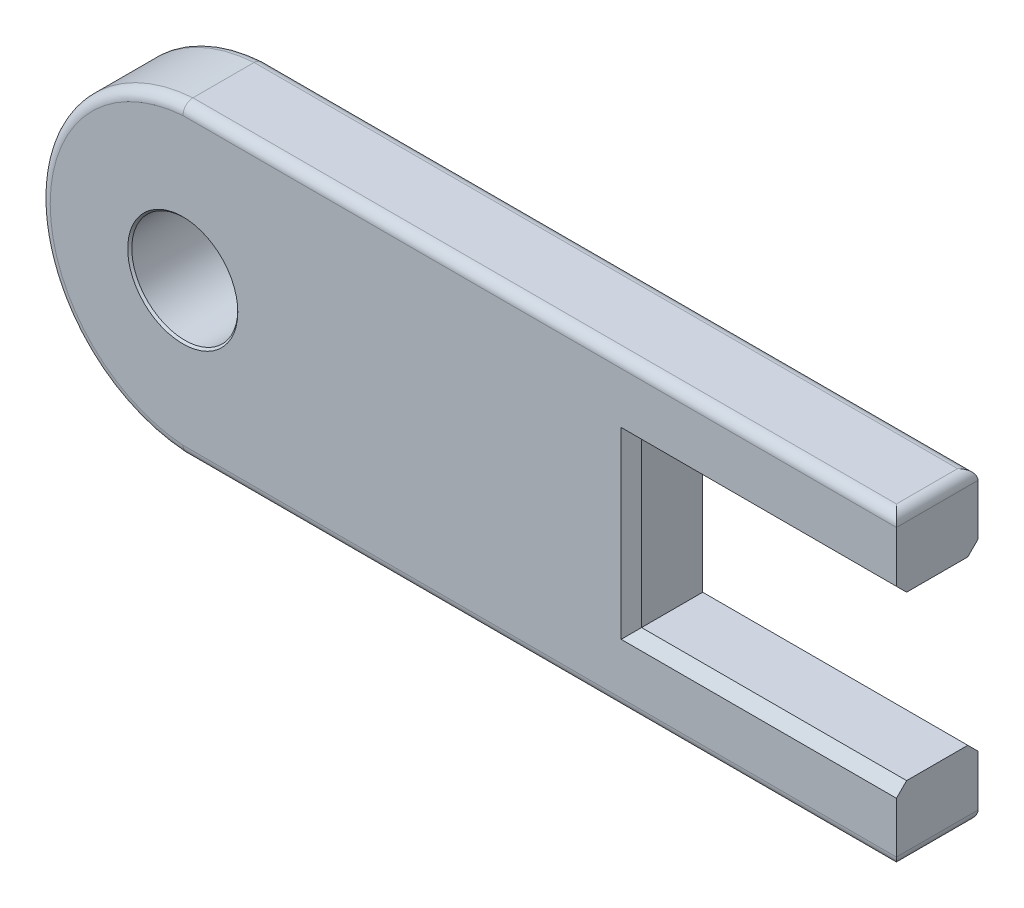
ISO-10303-21;
HEADER;
FILE_DESCRIPTION(('STEP AP214'),'2;1');
FILE_NAME('part.step','',(''),(''),'','','');
FILE_SCHEMA(('AUTOMOTIVE_DESIGN { 1 0 10303 214 1 1 1 1 }'));
ENDSEC;
DATA;
#1=APPLICATION_CONTEXT('core data for automotive mechanical design processes');
#2=APPLICATION_PROTOCOL_DEFINITION('international standard','automotive_design',2000,#1);
#3=PRODUCT_CONTEXT('',#1,'mechanical');
#4=PRODUCT('Part','Part','',(#3));
#5=PRODUCT_RELATED_PRODUCT_CATEGORY('part','',(#4));
#6=PRODUCT_DEFINITION_FORMATION('','',#4);
#7=PRODUCT_DEFINITION_CONTEXT('part definition',#1,'design');
#8=PRODUCT_DEFINITION('design','',#6,#7);
#9=PRODUCT_DEFINITION_SHAPE('','',#8);
#10=(LENGTH_UNIT() NAMED_UNIT(*) SI_UNIT(.MILLI.,.METRE.));
#11=(NAMED_UNIT(*) PLANE_ANGLE_UNIT() SI_UNIT($,.RADIAN.));
#12=(NAMED_UNIT(*) SI_UNIT($,.STERADIAN.) SOLID_ANGLE_UNIT());
#13=UNCERTAINTY_MEASURE_WITH_UNIT(LENGTH_MEASURE(1.E-05),#10,'distance_accuracy_value','');
#14=(GEOMETRIC_REPRESENTATION_CONTEXT(3) GLOBAL_UNCERTAINTY_ASSIGNED_CONTEXT((#13)) GLOBAL_UNIT_ASSIGNED_CONTEXT((#10,
#11,#12)) REPRESENTATION_CONTEXT('',''));
#15=CARTESIAN_POINT('',(0.,0.,0.));
#16=DIRECTION('',(0.,0.,1.));
#17=DIRECTION('',(1.,0.,0.));
#18=AXIS2_PLACEMENT_3D('',#15,#16,#17);
#19=CARTESIAN_POINT('',(-271.737221263485,0.,20.));
#20=DIRECTION('',(0.,0.,-1.));
#21=DIRECTION('',(-1.,0.,0.));
#22=AXIS2_PLACEMENT_3D('',#19,#20,#21);
#23=CYLINDRICAL_SURFACE('',#22,75.1785714285714);
#24=DIRECTION('',(0.,0.,-1.));
#25=VECTOR('',#24,1.);
#26=CARTESIAN_POINT('',(-276.915792692057,75.,20.));
#27=LINE('',#26,#25);
#28=CARTESIAN_POINT('',(-276.915792692057,75.,15.));
#29=VERTEX_POINT('',#28);
#30=CARTESIAN_POINT('',(-276.915792692057,75.,-15.));
#31=VERTEX_POINT('',#30);
#32=EDGE_CURVE('E336',#29,#31,#27,.T.);
#33=ORIENTED_EDGE('',*,*,#32,.T.);
#34=CARTESIAN_POINT('',(-271.737221263485,0.,-15.));
#35=DIRECTION('',(0.,0.,1.));
#36=DIRECTION('',(1.,0.,0.));
#37=AXIS2_PLACEMENT_3D('',#34,#35,#36);
#38=CIRCLE('',#37,75.1785714285714);
#39=CARTESIAN_POINT('',(-276.915792692057,-75.,-15.));
#40=VERTEX_POINT('',#39);
#41=EDGE_CURVE('E207',#31,#40,#38,.T.);
#42=ORIENTED_EDGE('',*,*,#41,.T.);
#43=DIRECTION('',(0.,0.,-1.));
#44=VECTOR('',#43,1.);
#45=CARTESIAN_POINT('',(-276.915792692057,-75.,20.));
#46=LINE('',#45,#44);
#47=CARTESIAN_POINT('',(-276.915792692057,-75.,15.));
#48=VERTEX_POINT('',#47);
#49=EDGE_CURVE('E184',#48,#40,#46,.T.);
#50=ORIENTED_EDGE('',*,*,#49,.F.);
#51=CARTESIAN_POINT('',(-271.737221263485,0.,15.));
#52=DIRECTION('',(0.,0.,1.));
#53=DIRECTION('',(1.,0.,0.));
#54=AXIS2_PLACEMENT_3D('',#51,#52,#53);
#55=CIRCLE('',#54,75.1785714285714);
#56=EDGE_CURVE('E177',#48,#29,#55,.F.);
#57=ORIENTED_EDGE('',*,*,#56,.T.);
#58=EDGE_LOOP('',(#33,#42,#50,#57));
#59=FACE_BOUND('',#58,.T.);
#60=ADVANCED_FACE('F32',(#59),#23,.T.);
#61=CARTESIAN_POINT('',(-276.915792692057,-75.,20.));
#62=DIRECTION('',(0.,1.,0.));
#63=DIRECTION('',(-1.,0.,0.));
#64=AXIS2_PLACEMENT_3D('',#61,#62,#63);
#65=PLANE('',#64);
#66=ORIENTED_EDGE('',*,*,#49,.T.);
#67=DIRECTION('',(1.,0.,0.));
#68=VECTOR('',#67,1.);
#69=CARTESIAN_POINT('',(-276.915792692057,-75.,-15.));
#70=LINE('',#69,#68);
#71=CARTESIAN_POINT('',(68.0842073079434,-75.,-15.));
#72=VERTEX_POINT('',#71);
#73=EDGE_CURVE('E193',#40,#72,#70,.T.);
#74=ORIENTED_EDGE('',*,*,#73,.T.);
#75=DIRECTION('',(0.,0.,-1.));
#76=VECTOR('',#75,1.);
#77=CARTESIAN_POINT('',(68.0842073079434,-75.,20.));
#78=LINE('',#77,#76);
#79=CARTESIAN_POINT('',(68.0842073079434,-75.,15.));
#80=VERTEX_POINT('',#79);
#81=EDGE_CURVE('E167',#72,#80,#78,.F.);
#82=ORIENTED_EDGE('',*,*,#81,.T.);
#83=DIRECTION('',(1.,0.,0.));
#84=VECTOR('',#83,1.);
#85=CARTESIAN_POINT('',(-276.915792692057,-75.,15.));
#86=LINE('',#85,#84);
#87=EDGE_CURVE('E183',#80,#48,#86,.F.);
#88=ORIENTED_EDGE('',*,*,#87,.T.);
#89=EDGE_LOOP('',(#66,#74,#82,#88));
#90=FACE_BOUND('',#89,.T.);
#91=ADVANCED_FACE('F304',(#90),#65,.F.);
#92=CARTESIAN_POINT('',(73.0842073079434,-39.9999999999999,20.));
#93=DIRECTION('',(1.,0.,0.));
#94=DIRECTION('',(0.,1.,0.));
#95=AXIS2_PLACEMENT_3D('',#92,#93,#94);
#96=PLANE('',#95);
#97=DIRECTION('',(0.,-1.,0.));
#98=VECTOR('',#97,1.);
#99=CARTESIAN_POINT('',(73.0842073079434,-39.9999999999999,-20.));
#100=LINE('',#99,#98);
#101=CARTESIAN_POINT('',(73.0842073079434,-45.,-20.));
#102=VERTEX_POINT('',#101);
#103=CARTESIAN_POINT('',(73.0842073079434,-70.,-20.));
#104=VERTEX_POINT('',#103);
#105=EDGE_CURVE('E144',#102,#104,#100,.T.);
#106=ORIENTED_EDGE('',*,*,#105,.F.);
#107=DIRECTION('',(0.,0.707106781186548,0.707106781186548));
#108=VECTOR('',#107,1.);
#109=CARTESIAN_POINT('',(73.0842073079434,-22.5,2.50000000000003));
#110=LINE('',#109,#108);
#111=CARTESIAN_POINT('',(73.0842073079434,-39.9999999999999,-14.9999999999999));
#112=VERTEX_POINT('',#111);
#113=EDGE_CURVE('E386',#102,#112,#110,.T.);
#114=ORIENTED_EDGE('',*,*,#113,.T.);
#115=DIRECTION('',(0.,0.,-1.));
#116=VECTOR('',#115,1.);
#117=CARTESIAN_POINT('',(73.0842073079434,-39.9999999999999,20.));
#118=LINE('',#117,#116);
#119=CARTESIAN_POINT('',(73.0842073079434,-39.9999999999999,15.));
#120=VERTEX_POINT('',#119);
#121=EDGE_CURVE('E188',#120,#112,#118,.T.);
#122=ORIENTED_EDGE('',*,*,#121,.F.);
#123=DIRECTION('',(0.,0.707106781186548,-0.707106781186548));
#124=VECTOR('',#123,1.);
#125=CARTESIAN_POINT('',(73.0842073079434,-42.4999999999999,17.5));
#126=LINE('',#125,#124);
#127=CARTESIAN_POINT('',(73.0842073079434,-44.9999999999999,20.));
#128=VERTEX_POINT('',#127);
#129=EDGE_CURVE('E384',#120,#128,#126,.F.);
#130=ORIENTED_EDGE('',*,*,#129,.T.);
#131=DIRECTION('',(0.,-1.,0.));
#132=VECTOR('',#131,1.);
#133=CARTESIAN_POINT('',(73.0842073079434,-39.9999999999999,20.));
#134=LINE('',#133,#132);
#135=CARTESIAN_POINT('',(73.0842073079434,-70.,20.));
#136=VERTEX_POINT('',#135);
#137=EDGE_CURVE('E181',#128,#136,#134,.T.);
#138=ORIENTED_EDGE('',*,*,#137,.T.);
#139=DIRECTION('',(0.,0.,-1.));
#140=VECTOR('',#139,1.);
#141=CARTESIAN_POINT('',(73.0842073079434,-70.,-20.));
#142=LINE('',#141,#140);
#143=EDGE_CURVE('E165',#136,#104,#142,.T.);
#144=ORIENTED_EDGE('',*,*,#143,.T.);
#145=EDGE_LOOP('',(#106,#114,#122,#130,#138,#144));
#146=FACE_BOUND('',#145,.T.);
#147=ADVANCED_FACE('F180',(#146),#96,.T.);
#148=CARTESIAN_POINT('',(-56.9157926920566,-39.9999999999999,20.));
#149=DIRECTION('',(0.,1.,0.));
#150=DIRECTION('',(0.,0.,1.));
#151=AXIS2_PLACEMENT_3D('',#148,#149,#150);
#152=PLANE('',#151);
#153=ORIENTED_EDGE('',*,*,#121,.T.);
#154=DIRECTION('',(-1.,0.,0.));
#155=VECTOR('',#154,1.);
#156=CARTESIAN_POINT('',(-56.9157926920566,-39.9999999999999,-14.9999999999999));
#157=LINE('',#156,#155);
#158=CARTESIAN_POINT('',(-56.9157926920566,-39.9999999999999,-14.9999999999999));
#159=VERTEX_POINT('',#158);
#160=EDGE_CURVE('E390',#112,#159,#157,.T.);
#161=ORIENTED_EDGE('',*,*,#160,.T.);
#162=DIRECTION('',(0.,0.,-1.));
#163=VECTOR('',#162,1.);
#164=CARTESIAN_POINT('',(-56.9157926920566,-39.9999999999999,20.));
#165=LINE('',#164,#163);
#166=CARTESIAN_POINT('',(-56.9157926920566,-39.9999999999999,15.));
#167=VERTEX_POINT('',#166);
#168=EDGE_CURVE('E410',#167,#159,#165,.T.);
#169=ORIENTED_EDGE('',*,*,#168,.F.);
#170=DIRECTION('',(1.,0.,0.));
#171=VECTOR('',#170,1.);
#172=CARTESIAN_POINT('',(-56.9157926920566,-39.9999999999999,15.));
#173=LINE('',#172,#171);
#174=EDGE_CURVE('E388',#167,#120,#173,.T.);
#175=ORIENTED_EDGE('',*,*,#174,.T.);
#176=EDGE_LOOP('',(#153,#161,#169,#175));
#177=FACE_BOUND('',#176,.T.);
#178=ADVANCED_FACE('F407',(#177),#152,.T.);
#179=CARTESIAN_POINT('',(-56.9157926920566,40.,20.));
#180=DIRECTION('',(1.,0.,0.));
#181=DIRECTION('',(0.,1.,0.));
#182=AXIS2_PLACEMENT_3D('',#179,#180,#181);
#183=PLANE('',#182);
#184=ORIENTED_EDGE('',*,*,#168,.T.);
#185=DIRECTION('',(0.,1.,0.));
#186=VECTOR('',#185,1.);
#187=CARTESIAN_POINT('',(-56.9157926920566,40.,-14.9999999999999));
#188=LINE('',#187,#186);
#189=CARTESIAN_POINT('',(-56.9157926920566,40.,-14.9999999999999));
#190=VERTEX_POINT('',#189);
#191=EDGE_CURVE('E382',#159,#190,#188,.T.);
#192=ORIENTED_EDGE('',*,*,#191,.T.);
#193=DIRECTION('',(0.,0.,-1.));
#194=VECTOR('',#193,1.);
#195=CARTESIAN_POINT('',(-56.9157926920566,40.,20.));
#196=LINE('',#195,#194);
#197=CARTESIAN_POINT('',(-56.9157926920566,40.,15.));
#198=VERTEX_POINT('',#197);
#199=EDGE_CURVE('E411',#198,#190,#196,.T.);
#200=ORIENTED_EDGE('',*,*,#199,.F.);
#201=DIRECTION('',(0.,-1.,0.));
#202=VECTOR('',#201,1.);
#203=CARTESIAN_POINT('',(-56.9157926920566,40.,15.));
#204=LINE('',#203,#202);
#205=EDGE_CURVE('E380',#198,#167,#204,.T.);
#206=ORIENTED_EDGE('',*,*,#205,.T.);
#207=EDGE_LOOP('',(#184,#192,#200,#206));
#208=FACE_BOUND('',#207,.T.);
#209=ADVANCED_FACE('F432',(#208),#183,.T.);
#210=CARTESIAN_POINT('',(73.0842073079434,40.,20.));
#211=DIRECTION('',(0.,-1.,0.));
#212=DIRECTION('',(1.,0.,0.));
#213=AXIS2_PLACEMENT_3D('',#210,#211,#212);
#214=PLANE('',#213);
#215=ORIENTED_EDGE('',*,*,#199,.T.);
#216=DIRECTION('',(1.,0.,0.));
#217=VECTOR('',#216,1.);
#218=CARTESIAN_POINT('',(73.0842073079434,40.,-14.9999999999999));
#219=LINE('',#218,#217);
#220=CARTESIAN_POINT('',(73.0842073079434,40.,-14.9999999999999));
#221=VERTEX_POINT('',#220);
#222=EDGE_CURVE('E374',#190,#221,#219,.T.);
#223=ORIENTED_EDGE('',*,*,#222,.T.);
#224=DIRECTION('',(0.,0.,-1.));
#225=VECTOR('',#224,1.);
#226=CARTESIAN_POINT('',(73.0842073079434,40.,20.));
#227=LINE('',#226,#225);
#228=CARTESIAN_POINT('',(73.0842073079434,40.,15.));
#229=VERTEX_POINT('',#228);
#230=EDGE_CURVE('E343',#229,#221,#227,.T.);
#231=ORIENTED_EDGE('',*,*,#230,.F.);
#232=DIRECTION('',(-1.,0.,0.));
#233=VECTOR('',#232,1.);
#234=CARTESIAN_POINT('',(73.0842073079434,40.,15.));
#235=LINE('',#234,#233);
#236=EDGE_CURVE('E371',#229,#198,#235,.T.);
#237=ORIENTED_EDGE('',*,*,#236,.T.);
#238=EDGE_LOOP('',(#215,#223,#231,#237));
#239=FACE_BOUND('',#238,.T.);
#240=ADVANCED_FACE('F429',(#239),#214,.T.);
#241=CARTESIAN_POINT('',(73.0842073079434,75.,20.));
#242=DIRECTION('',(1.,0.,0.));
#243=DIRECTION('',(0.,0.,-1.));
#244=AXIS2_PLACEMENT_3D('',#241,#242,#243);
#245=PLANE('',#244);
#246=ORIENTED_EDGE('',*,*,#230,.T.);
#247=DIRECTION('',(0.,0.707106781186547,-0.707106781186548));
#248=VECTOR('',#247,1.);
#249=CARTESIAN_POINT('',(73.0842073079434,40.,-15.));
#250=LINE('',#249,#248);
#251=CARTESIAN_POINT('',(73.0842073079434,45.,-20.));
#252=VERTEX_POINT('',#251);
#253=EDGE_CURVE('E378',#221,#252,#250,.T.);
#254=ORIENTED_EDGE('',*,*,#253,.T.);
#255=DIRECTION('',(0.,-1.,0.));
#256=VECTOR('',#255,1.);
#257=CARTESIAN_POINT('',(73.0842073079434,75.,-20.));
#258=LINE('',#257,#256);
#259=CARTESIAN_POINT('',(73.0842073079434,70.,-20.));
#260=VERTEX_POINT('',#259);
#261=EDGE_CURVE('E156',#260,#252,#258,.T.);
#262=ORIENTED_EDGE('',*,*,#261,.F.);
#263=DIRECTION('',(0.,0.,-1.));
#264=VECTOR('',#263,1.);
#265=CARTESIAN_POINT('',(73.0842073079434,70.,20.));
#266=LINE('',#265,#264);
#267=CARTESIAN_POINT('',(73.0842073079434,70.,20.));
#268=VERTEX_POINT('',#267);
#269=EDGE_CURVE('E201',#260,#268,#266,.F.);
#270=ORIENTED_EDGE('',*,*,#269,.T.);
#271=DIRECTION('',(0.,-1.,0.));
#272=VECTOR('',#271,1.);
#273=CARTESIAN_POINT('',(73.0842073079434,75.,20.));
#274=LINE('',#273,#272);
#275=CARTESIAN_POINT('',(73.0842073079434,45.,20.));
#276=VERTEX_POINT('',#275);
#277=EDGE_CURVE('E344',#268,#276,#274,.T.);
#278=ORIENTED_EDGE('',*,*,#277,.T.);
#279=DIRECTION('',(0.,0.707106781186547,0.707106781186548));
#280=VECTOR('',#279,1.);
#281=CARTESIAN_POINT('',(73.0842073079434,60.,35.));
#282=LINE('',#281,#280);
#283=EDGE_CURVE('E376',#276,#229,#282,.F.);
#284=ORIENTED_EDGE('',*,*,#283,.T.);
#285=EDGE_LOOP('',(#246,#254,#262,#270,#278,#284));
#286=FACE_BOUND('',#285,.T.);
#287=ADVANCED_FACE('F424',(#286),#245,.T.);
#288=CARTESIAN_POINT('',(-276.915792692057,75.,20.));
#289=DIRECTION('',(0.,1.,0.));
#290=DIRECTION('',(-1.,0.,0.));
#291=AXIS2_PLACEMENT_3D('',#288,#289,#290);
#292=PLANE('',#291);
#293=DIRECTION('',(0.,0.,-1.));
#294=VECTOR('',#293,1.);
#295=CARTESIAN_POINT('',(68.0842073079434,75.,20.));
#296=LINE('',#295,#294);
#297=CARTESIAN_POINT('',(68.0842073079434,75.,15.));
#298=VERTEX_POINT('',#297);
#299=CARTESIAN_POINT('',(68.0842073079434,75.,-15.));
#300=VERTEX_POINT('',#299);
#301=EDGE_CURVE('E197',#298,#300,#296,.T.);
#302=ORIENTED_EDGE('',*,*,#301,.T.);
#303=DIRECTION('',(1.,0.,0.));
#304=VECTOR('',#303,1.);
#305=CARTESIAN_POINT('',(-276.915792692057,75.,-15.));
#306=LINE('',#305,#304);
#307=EDGE_CURVE('E199',#300,#31,#306,.F.);
#308=ORIENTED_EDGE('',*,*,#307,.T.);
#309=ORIENTED_EDGE('',*,*,#32,.F.);
#310=DIRECTION('',(1.,0.,0.));
#311=VECTOR('',#310,1.);
#312=CARTESIAN_POINT('',(-276.915792692057,75.,15.));
#313=LINE('',#312,#311);
#314=EDGE_CURVE('E195',#29,#298,#313,.T.);
#315=ORIENTED_EDGE('',*,*,#314,.T.);
#316=EDGE_LOOP('',(#302,#308,#309,#315));
#317=FACE_BOUND('',#316,.T.);
#318=ADVANCED_FACE('F340',(#317),#292,.T.);
#319=CARTESIAN_POINT('',(-271.737221263485,0.,20.));
#320=DIRECTION('',(0.,0.,1.));
#321=DIRECTION('',(1.,0.,0.));
#322=AXIS2_PLACEMENT_3D('',#319,#320,#321);
#323=PLANE('',#322);
#324=CARTESIAN_POINT('',(-276.915792692057,0.,20.));
#325=DIRECTION('',(0.,0.,1.));
#326=DIRECTION('',(1.,0.,0.));
#327=AXIS2_PLACEMENT_3D('',#324,#325,#326);
#328=CIRCLE('',#327,27.0000000000001);
#329=CARTESIAN_POINT('',(-249.915792692056,0.,20.));
#330=VERTEX_POINT('',#329);
#331=EDGE_CURVE('E359',#330,#330,#328,.F.);
#332=ORIENTED_EDGE('',*,*,#331,.T.);
#333=EDGE_LOOP('',(#332));
#334=FACE_BOUND('',#333,.T.);
#335=DIRECTION('',(0.,1.,0.));
#336=VECTOR('',#335,1.);
#337=CARTESIAN_POINT('',(-61.9157926920566,0.,20.));
#338=LINE('',#337,#336);
#339=CARTESIAN_POINT('',(-61.9157926920566,-44.9999999999999,20.));
#340=VERTEX_POINT('',#339);
#341=CARTESIAN_POINT('',(-61.9157926920566,45.,20.));
#342=VERTEX_POINT('',#341);
#343=EDGE_CURVE('E41',#340,#342,#338,.T.);
#344=ORIENTED_EDGE('',*,*,#343,.T.);
#345=DIRECTION('',(1.,0.,0.));
#346=VECTOR('',#345,1.);
#347=CARTESIAN_POINT('',(-271.737221263485,45.,20.));
#348=LINE('',#347,#346);
#349=EDGE_CURVE('E11',#342,#276,#348,.T.);
#350=ORIENTED_EDGE('',*,*,#349,.T.);
#351=ORIENTED_EDGE('',*,*,#277,.F.);
#352=DIRECTION('',(1.,0.,0.));
#353=VECTOR('',#352,1.);
#354=CARTESIAN_POINT('',(-271.737221263485,70.,20.));
#355=LINE('',#354,#353);
#356=CARTESIAN_POINT('',(-276.740409022815,70.,20.));
#357=VERTEX_POINT('',#356);
#358=EDGE_CURVE('E209',#268,#357,#355,.F.);
#359=ORIENTED_EDGE('',*,*,#358,.T.);
#360=CARTESIAN_POINT('',(-271.737221263485,0.,20.));
#361=DIRECTION('',(0.,0.,1.));
#362=DIRECTION('',(1.,0.,0.));
#363=AXIS2_PLACEMENT_3D('',#360,#361,#362);
#364=CIRCLE('',#363,70.1785714285714);
#365=CARTESIAN_POINT('',(-276.740409022815,-70.,20.));
#366=VERTEX_POINT('',#365);
#367=EDGE_CURVE('E211',#357,#366,#364,.T.);
#368=ORIENTED_EDGE('',*,*,#367,.T.);
#369=DIRECTION('',(1.,0.,0.));
#370=VECTOR('',#369,1.);
#371=CARTESIAN_POINT('',(73.0842073079434,-70.,20.));
#372=LINE('',#371,#370);
#373=EDGE_CURVE('E213',#366,#136,#372,.T.);
#374=ORIENTED_EDGE('',*,*,#373,.T.);
#375=ORIENTED_EDGE('',*,*,#137,.F.);
#376=DIRECTION('',(-1.,0.,0.));
#377=VECTOR('',#376,1.);
#378=CARTESIAN_POINT('',(-271.737221263485,-44.9999999999999,20.));
#379=LINE('',#378,#377);
#380=EDGE_CURVE('E52',#128,#340,#379,.T.);
#381=ORIENTED_EDGE('',*,*,#380,.T.);
#382=EDGE_LOOP('',(#344,#350,#351,#359,#368,#374,#375,#381));
#383=FACE_BOUND('',#382,.T.);
#384=ADVANCED_FACE('F490',(#334,#383),#323,.T.);
#385=CARTESIAN_POINT('',(-271.737221263485,0.,-20.));
#386=DIRECTION('',(0.,0.,1.));
#387=DIRECTION('',(1.,0.,0.));
#388=AXIS2_PLACEMENT_3D('',#385,#386,#387);
#389=PLANE('',#388);
#390=CARTESIAN_POINT('',(-276.915792692057,0.,-20.));
#391=DIRECTION('',(0.,0.,1.));
#392=DIRECTION('',(1.,0.,0.));
#393=AXIS2_PLACEMENT_3D('',#390,#391,#392);
#394=CIRCLE('',#393,27.);
#395=CARTESIAN_POINT('',(-249.915792692057,0.,-20.));
#396=VERTEX_POINT('',#395);
#397=EDGE_CURVE('E362',#396,#396,#394,.T.);
#398=ORIENTED_EDGE('',*,*,#397,.T.);
#399=EDGE_LOOP('',(#398));
#400=FACE_BOUND('',#399,.T.);
#401=ORIENTED_EDGE('',*,*,#261,.T.);
#402=DIRECTION('',(-1.,0.,0.));
#403=VECTOR('',#402,1.);
#404=CARTESIAN_POINT('',(-56.9157926920566,45.,-20.));
#405=LINE('',#404,#403);
#406=CARTESIAN_POINT('',(-61.9157926920567,45.,-20.));
#407=VERTEX_POINT('',#406);
#408=EDGE_CURVE('E368',#252,#407,#405,.T.);
#409=ORIENTED_EDGE('',*,*,#408,.T.);
#410=DIRECTION('',(0.,-1.,0.));
#411=VECTOR('',#410,1.);
#412=CARTESIAN_POINT('',(-61.9157926920567,-39.9999999999999,-20.));
#413=LINE('',#412,#411);
#414=CARTESIAN_POINT('',(-61.9157926920567,-45.,-20.));
#415=VERTEX_POINT('',#414);
#416=EDGE_CURVE('E366',#407,#415,#413,.T.);
#417=ORIENTED_EDGE('',*,*,#416,.T.);
#418=DIRECTION('',(1.,0.,0.));
#419=VECTOR('',#418,1.);
#420=CARTESIAN_POINT('',(73.0842073079434,-45.,-20.));
#421=LINE('',#420,#419);
#422=EDGE_CURVE('E152',#415,#102,#421,.T.);
#423=ORIENTED_EDGE('',*,*,#422,.T.);
#424=ORIENTED_EDGE('',*,*,#105,.T.);
#425=DIRECTION('',(1.,0.,0.));
#426=VECTOR('',#425,1.);
#427=CARTESIAN_POINT('',(-271.737221263485,-70.,-20.));
#428=LINE('',#427,#426);
#429=CARTESIAN_POINT('',(-276.740409022815,-70.,-20.));
#430=VERTEX_POINT('',#429);
#431=EDGE_CURVE('E149',#104,#430,#428,.F.);
#432=ORIENTED_EDGE('',*,*,#431,.T.);
#433=CARTESIAN_POINT('',(-271.737221263485,0.,-20.));
#434=DIRECTION('',(0.,0.,1.));
#435=DIRECTION('',(1.,0.,0.));
#436=AXIS2_PLACEMENT_3D('',#433,#434,#435);
#437=CIRCLE('',#436,70.1785714285714);
#438=CARTESIAN_POINT('',(-276.740409022815,70.,-20.));
#439=VERTEX_POINT('',#438);
#440=EDGE_CURVE('E203',#430,#439,#437,.F.);
#441=ORIENTED_EDGE('',*,*,#440,.T.);
#442=DIRECTION('',(1.,0.,0.));
#443=VECTOR('',#442,1.);
#444=CARTESIAN_POINT('',(73.0842073079434,70.,-20.));
#445=LINE('',#444,#443);
#446=EDGE_CURVE('E178',#439,#260,#445,.T.);
#447=ORIENTED_EDGE('',*,*,#446,.T.);
#448=EDGE_LOOP('',(#401,#409,#417,#423,#424,#432,#441,#447));
#449=FACE_BOUND('',#448,.T.);
#450=ADVANCED_FACE('F147',(#400,#449),#389,.F.);
#451=CARTESIAN_POINT('',(-276.915792692057,0.,-20.));
#452=DIRECTION('',(0.,0.,1.));
#453=DIRECTION('',(1.,0.,0.));
#454=AXIS2_PLACEMENT_3D('',#451,#452,#453);
#455=CYLINDRICAL_SURFACE('',#454,26.);
#456=CARTESIAN_POINT('',(-276.915792692057,0.,18.9999999999999));
#457=DIRECTION('',(0.,0.,1.));
#458=DIRECTION('',(1.,0.,0.));
#459=AXIS2_PLACEMENT_3D('',#456,#457,#458);
#460=CIRCLE('',#459,26.);
#461=CARTESIAN_POINT('',(-250.915792692057,0.,18.9999999999999));
#462=VERTEX_POINT('',#461);
#463=EDGE_CURVE('E356',#462,#462,#460,.T.);
#464=ORIENTED_EDGE('',*,*,#463,.T.);
#465=EDGE_LOOP('',(#464));
#466=FACE_BOUND('',#465,.T.);
#467=CARTESIAN_POINT('',(-276.915792692057,0.,-19.));
#468=DIRECTION('',(0.,0.,1.));
#469=DIRECTION('',(1.,0.,0.));
#470=AXIS2_PLACEMENT_3D('',#467,#468,#469);
#471=CIRCLE('',#470,26.);
#472=CARTESIAN_POINT('',(-250.915792692057,0.,-19.));
#473=VERTEX_POINT('',#472);
#474=EDGE_CURVE('E214',#473,#473,#471,.F.);
#475=ORIENTED_EDGE('',*,*,#474,.T.);
#476=EDGE_LOOP('',(#475));
#477=FACE_BOUND('',#476,.T.);
#478=ADVANCED_FACE('F270',(#466,#477),#455,.F.);
#479=CARTESIAN_POINT('',(68.0842073079434,70.,20.));
#480=DIRECTION('',(0.,0.,-1.));
#481=DIRECTION('',(-1.,0.,0.));
#482=AXIS2_PLACEMENT_3D('',#479,#480,#481);
#483=CYLINDRICAL_SURFACE('',#482,5.);
#484=CARTESIAN_POINT('',(68.0842073079434,70.,-15.));
#485=DIRECTION('',(-0.707106781186547,0.,-0.707106781186547));
#486=DIRECTION('',(-0.707106781186547,0.,0.707106781186547));
#487=AXIS2_PLACEMENT_3D('',#484,#485,#486);
#488=ELLIPSE('',#487,7.07106781186547,5.);
#489=EDGE_CURVE('E350',#300,#260,#488,.T.);
#490=ORIENTED_EDGE('',*,*,#489,.F.);
#491=ORIENTED_EDGE('',*,*,#301,.F.);
#492=CARTESIAN_POINT('',(68.0842073079434,70.,15.));
#493=DIRECTION('',(0.707106781186547,0.,-0.707106781186547));
#494=DIRECTION('',(0.707106781186547,0.,0.707106781186547));
#495=AXIS2_PLACEMENT_3D('',#492,#493,#494);
#496=ELLIPSE('',#495,7.07106781186547,5.);
#497=EDGE_CURVE('E157',#268,#298,#496,.F.);
#498=ORIENTED_EDGE('',*,*,#497,.F.);
#499=ORIENTED_EDGE('',*,*,#269,.F.);
#500=EDGE_LOOP('',(#490,#491,#498,#499));
#501=FACE_BOUND('',#500,.T.);
#502=ADVANCED_FACE('F266',(#501),#483,.T.);
#503=CARTESIAN_POINT('',(-276.915792692057,70.,15.));
#504=DIRECTION('',(1.,0.,0.));
#505=DIRECTION('',(0.,1.,0.));
#506=AXIS2_PLACEMENT_3D('',#503,#504,#505);
#507=CYLINDRICAL_SURFACE('',#506,5.);
#508=ORIENTED_EDGE('',*,*,#497,.T.);
#509=ORIENTED_EDGE('',*,*,#314,.F.);
#510=CARTESIAN_POINT('',(-276.915792692057,75.,15.));
#511=CARTESIAN_POINT('',(-276.915793163351,75.0000151629384,15.140564308152));
#512=CARTESIAN_POINT('',(-276.915588315765,74.9940731395068,15.2811264121954));
#513=CARTESIAN_POINT('',(-276.914771388705,74.97038425399,15.5612445614426));
#514=CARTESIAN_POINT('',(-276.914159329183,74.9526379702612,15.7008006555978));
#515=CARTESIAN_POINT('',(-276.912531958131,74.9054667346417,15.9778212856425));
#516=CARTESIAN_POINT('',(-276.911516931586,74.876050036227,16.1152872285299));
#517=CARTESIAN_POINT('',(-276.909090316268,74.8057527395026,16.3872504858607));
#518=CARTESIAN_POINT('',(-276.907678732239,74.764872278314,16.5217478357915));
#519=CARTESIAN_POINT('',(-276.904467584758,74.67192380357,16.7868590781649));
#520=CARTESIAN_POINT('',(-276.902667907862,74.6198525188126,16.9174718223585));
#521=CARTESIAN_POINT('',(-276.898691728097,74.5048798188991,17.173892224953));
#522=CARTESIAN_POINT('',(-276.896515086686,74.4419744220164,17.2996980958999));
#523=CARTESIAN_POINT('',(-276.891800938407,74.3058352959314,17.5454876740453));
#524=CARTESIAN_POINT('',(-276.889263644222,74.2326076541546,17.665474757152));
#525=CARTESIAN_POINT('',(-276.883842784694,74.0762903485984,17.8988952864565));
#526=CARTESIAN_POINT('',(-276.880959099268,73.9931972649603,18.012326439661));
#527=CARTESIAN_POINT('',(-276.874864878637,73.8177576619328,18.2317894409161));
#528=CARTESIAN_POINT('',(-276.871654330582,73.7254107787846,18.3378209978169));
#529=CARTESIAN_POINT('',(-276.864927548585,73.5321235101178,18.5417281186155));
#530=CARTESIAN_POINT('',(-276.861411314434,73.431183118742,18.6396036769542));
#531=CARTESIAN_POINT('',(-276.854094540315,73.2213747696921,18.8265515280921));
#532=CARTESIAN_POINT('',(-276.850293860263,73.1125029066448,18.9156194325152));
#533=CARTESIAN_POINT('',(-276.842436333779,72.8876896506065,19.0842361460688));
#534=CARTESIAN_POINT('',(-276.838379576506,72.7717507186586,19.1637882407273));
#535=CARTESIAN_POINT('',(-276.830030883697,72.5334529660415,19.3129336427953));
#536=CARTESIAN_POINT('',(-276.825738677534,72.4110867649723,19.3825151435859));
#537=CARTESIAN_POINT('',(-276.816953992077,72.1609771550748,19.5110910717398));
#538=CARTESIAN_POINT('',(-276.812461586324,72.0332357217392,19.5700893473875));
#539=CARTESIAN_POINT('',(-276.803307684091,71.7733042138338,19.6770860983853));
#540=CARTESIAN_POINT('',(-276.798646272187,71.6411163667335,19.7250899900515));
#541=CARTESIAN_POINT('',(-276.78918577806,71.3732189140297,19.8097819448585));
#542=CARTESIAN_POINT('',(-276.78438673696,71.2375103615198,19.8464733503664));
#543=CARTESIAN_POINT('',(-276.773446010654,70.9285777709014,19.9161768445889));
#544=CARTESIAN_POINT('',(-276.767273578694,70.7545993922035,19.9458735758953));
#545=CARTESIAN_POINT('',(-276.754837028542,70.4047165706363,19.9866984286438));
#546=CARTESIAN_POINT('',(-276.748573073248,70.2288156637174,19.9978562497683));
#547=CARTESIAN_POINT('',(-276.741668365319,70.0352873876982,19.9999067647078));
#548=CARTESIAN_POINT('',(-276.741038730672,70.0176430436875,20.0000001790643));
#549=CARTESIAN_POINT('',(-276.740409022815,70.,20.));
#550=B_SPLINE_CURVE_WITH_KNOTS('',3,(#510,#511,#512,#513,#514,#515,#516,#517,#518,#519,#520,
#521,#522,#523,#524,#525,#526,#527,#528,#529,#530,#531,#532,#533,#534,#535,#536,#537,#538,#539,
#540,#541,#542,#543,#544,#545,#546,#547,#548,#549),.UNSPECIFIED.,.F.,.F.,(4,2,2,2,2,2,2,2,2,2,2,
2,2,2,2,2,2,2,2,4),(0.,0.421564122742559,0.843107592232885,1.26435347037724,1.68559431010435,
2.10695845108832,2.52847778254125,2.94974955980458,3.37116779980704,3.79260261189578,
4.21403771122999,4.63568174186916,5.05717976848031,5.47917285637249,5.9010121862331,
6.32264325035817,6.7441496204721,7.272975732307,7.80095383502457,7.85392017153068),.UNSPECIFIED.);
#551=EDGE_CURVE('E250',#357,#29,#550,.F.);
#552=ORIENTED_EDGE('',*,*,#551,.F.);
#553=ORIENTED_EDGE('',*,*,#358,.F.);
#554=EDGE_LOOP('',(#508,#509,#552,#553));
#555=FACE_BOUND('',#554,.T.);
#556=ADVANCED_FACE('F260',(#555),#507,.T.);
#557=CARTESIAN_POINT('',(-271.737221263485,70.,-15.));
#558=DIRECTION('',(-1.,0.,0.));
#559=DIRECTION('',(0.,-1.,0.));
#560=AXIS2_PLACEMENT_3D('',#557,#558,#559);
#561=CYLINDRICAL_SURFACE('',#560,5.);
#562=ORIENTED_EDGE('',*,*,#489,.T.);
#563=ORIENTED_EDGE('',*,*,#446,.F.);
#564=CARTESIAN_POINT('',(-276.915792692057,75.,-15.));
#565=CARTESIAN_POINT('',(-276.915793163351,75.0000151629384,-15.140564308152));
#566=CARTESIAN_POINT('',(-276.915588315765,74.9940731395068,-15.2811264121954));
#567=CARTESIAN_POINT('',(-276.914771388705,74.97038425399,-15.5612445614426));
#568=CARTESIAN_POINT('',(-276.914159329183,74.9526379702612,-15.7008006555978));
#569=CARTESIAN_POINT('',(-276.912531958131,74.9054667346417,-15.9778212856425));
#570=CARTESIAN_POINT('',(-276.911516931586,74.876050036227,-16.1152872285299));
#571=CARTESIAN_POINT('',(-276.909090316268,74.8057527395026,-16.3872504858607));
#572=CARTESIAN_POINT('',(-276.907678732239,74.764872278314,-16.5217478357915));
#573=CARTESIAN_POINT('',(-276.904467584758,74.67192380357,-16.7868590781649));
#574=CARTESIAN_POINT('',(-276.902667907862,74.6198525188126,-16.9174718223585));
#575=CARTESIAN_POINT('',(-276.898691728097,74.5048798188991,-17.173892224953));
#576=CARTESIAN_POINT('',(-276.896515086686,74.4419744220164,-17.2996980958999));
#577=CARTESIAN_POINT('',(-276.891800938407,74.3058352959314,-17.5454876740453));
#578=CARTESIAN_POINT('',(-276.889263644222,74.2326076541546,-17.665474757152));
#579=CARTESIAN_POINT('',(-276.883842784694,74.0762903485984,-17.8988952864565));
#580=CARTESIAN_POINT('',(-276.880959099268,73.9931972649603,-18.012326439661));
#581=CARTESIAN_POINT('',(-276.874864878637,73.8177576619328,-18.2317894409161));
#582=CARTESIAN_POINT('',(-276.871654330582,73.7254107787846,-18.3378209978169));
#583=CARTESIAN_POINT('',(-276.864927548585,73.5321235101178,-18.5417281186155));
#584=CARTESIAN_POINT('',(-276.861411314434,73.431183118742,-18.6396036769542));
#585=CARTESIAN_POINT('',(-276.854094540315,73.2213747696921,-18.8265515280921));
#586=CARTESIAN_POINT('',(-276.850293860263,73.1125029066448,-18.9156194325152));
#587=CARTESIAN_POINT('',(-276.842436333779,72.8876896506065,-19.0842361460688));
#588=CARTESIAN_POINT('',(-276.838379576506,72.7717507186586,-19.1637882407273));
#589=CARTESIAN_POINT('',(-276.830030883697,72.5334529660415,-19.3129336427953));
#590=CARTESIAN_POINT('',(-276.825738677534,72.4110867649723,-19.3825151435859));
#591=CARTESIAN_POINT('',(-276.816953992077,72.1609771550748,-19.5110910717398));
#592=CARTESIAN_POINT('',(-276.812461586324,72.0332357217393,-19.5700893473875));
#593=CARTESIAN_POINT('',(-276.803307684091,71.7733042138338,-19.6770860983853));
#594=CARTESIAN_POINT('',(-276.798646272187,71.6411163667335,-19.7250899900515));
#595=CARTESIAN_POINT('',(-276.789185778061,71.3732189140297,-19.8097819448585));
#596=CARTESIAN_POINT('',(-276.784386736961,71.2375103615198,-19.8464733503664));
#597=CARTESIAN_POINT('',(-276.773446010653,70.9285777709014,-19.9161768445889));
#598=CARTESIAN_POINT('',(-276.767273578689,70.7545993922037,-19.9458735758953));
#599=CARTESIAN_POINT('',(-276.754837028548,70.4047165706361,-19.9866984286438));
#600=CARTESIAN_POINT('',(-276.748573073269,70.2288156637167,-19.9978562497683));
#601=CARTESIAN_POINT('',(-276.741668365323,70.0352873876981,-19.9999067647078));
#602=CARTESIAN_POINT('',(-276.741038730674,70.0176430436874,-20.0000001790643));
#603=CARTESIAN_POINT('',(-276.740409022815,70.,-20.));
#604=B_SPLINE_CURVE_WITH_KNOTS('',3,(#564,#565,#566,#567,#568,#569,#570,#571,#572,#573,#574,
#575,#576,#577,#578,#579,#580,#581,#582,#583,#584,#585,#586,#587,#588,#589,#590,#591,#592,#593,
#594,#595,#596,#597,#598,#599,#600,#601,#602,#603),.UNSPECIFIED.,.F.,.F.,(4,2,2,2,2,2,2,2,2,2,2,
2,2,2,2,2,2,2,2,4),(0.,0.421564122742557,0.84310759223288,1.26435347037725,1.68559431010435,
2.10695845108832,2.52847778254124,2.94974955980457,3.37116779980704,3.79260261189578,
4.21403771122998,4.63568174186916,5.05717976848031,5.47917285637249,5.90101218623309,
6.32264325035816,6.7441496204721,7.27297573230701,7.80095383502458,7.85392017153068),.UNSPECIFIED.);
#605=EDGE_CURVE('E242',#31,#439,#604,.T.);
#606=ORIENTED_EDGE('',*,*,#605,.F.);
#607=ORIENTED_EDGE('',*,*,#307,.F.);
#608=EDGE_LOOP('',(#562,#563,#606,#607));
#609=FACE_BOUND('',#608,.T.);
#610=ADVANCED_FACE('F257',(#609),#561,.T.);
#611=CARTESIAN_POINT('',(-271.737221263485,0.,15.));
#612=DIRECTION('',(0.,0.,1.));
#613=DIRECTION('',(1.,0.,0.));
#614=AXIS2_PLACEMENT_3D('',#611,#612,#613);
#615=TOROIDAL_SURFACE('',#614,70.1785714285714,5.);
#616=ORIENTED_EDGE('',*,*,#551,.T.);
#617=ORIENTED_EDGE('',*,*,#56,.F.);
#618=CARTESIAN_POINT('',(-276.915792692057,-75.,15.));
#619=CARTESIAN_POINT('',(-276.915793163351,-75.0000151629384,15.140564308152));
#620=CARTESIAN_POINT('',(-276.915588315765,-74.9940731395069,15.2811264121954));
#621=CARTESIAN_POINT('',(-276.914771388705,-74.97038425399,15.5612445614426));
#622=CARTESIAN_POINT('',(-276.914159329183,-74.9526379702612,15.7008006555978));
#623=CARTESIAN_POINT('',(-276.912531958131,-74.9054667346417,15.9778212856425));
#624=CARTESIAN_POINT('',(-276.911516931586,-74.876050036227,16.1152872285299));
#625=CARTESIAN_POINT('',(-276.909090316268,-74.8057527395026,16.3872504858607));
#626=CARTESIAN_POINT('',(-276.907678732239,-74.764872278314,16.5217478357915));
#627=CARTESIAN_POINT('',(-276.904467584758,-74.67192380357,16.7868590781649));
#628=CARTESIAN_POINT('',(-276.902667907862,-74.6198525188127,16.9174718223585));
#629=CARTESIAN_POINT('',(-276.898691728097,-74.5048798188991,17.173892224953));
#630=CARTESIAN_POINT('',(-276.896515086686,-74.4419744220164,17.2996980958999));
#631=CARTESIAN_POINT('',(-276.891800938407,-74.3058352959314,17.5454876740453));
#632=CARTESIAN_POINT('',(-276.889263644222,-74.2326076541546,17.665474757152));
#633=CARTESIAN_POINT('',(-276.883842784694,-74.0762903485984,17.8988952864565));
#634=CARTESIAN_POINT('',(-276.880959099268,-73.9931972649603,18.012326439661));
#635=CARTESIAN_POINT('',(-276.874864878637,-73.8177576619328,18.2317894409161));
#636=CARTESIAN_POINT('',(-276.871654330582,-73.7254107787846,18.3378209978169));
#637=CARTESIAN_POINT('',(-276.864927548585,-73.5321235101178,18.5417281186155));
#638=CARTESIAN_POINT('',(-276.861411314434,-73.431183118742,18.6396036769542));
#639=CARTESIAN_POINT('',(-276.854094540315,-73.2213747696921,18.8265515280921));
#640=CARTESIAN_POINT('',(-276.850293860263,-73.1125029066449,18.9156194325152));
#641=CARTESIAN_POINT('',(-276.842436333779,-72.8876896506066,19.0842361460688));
#642=CARTESIAN_POINT('',(-276.838379576506,-72.7717507186586,19.1637882407273));
#643=CARTESIAN_POINT('',(-276.830030883697,-72.5334529660415,19.3129336427953));
#644=CARTESIAN_POINT('',(-276.825738677534,-72.4110867649723,19.3825151435859));
#645=CARTESIAN_POINT('',(-276.816953992077,-72.1609771550748,19.5110910717398));
#646=CARTESIAN_POINT('',(-276.812461586324,-72.0332357217393,19.5700893473875));
#647=CARTESIAN_POINT('',(-276.803307684091,-71.7733042138338,19.6770860983853));
#648=CARTESIAN_POINT('',(-276.798646272187,-71.6411163667335,19.7250899900515));
#649=CARTESIAN_POINT('',(-276.78918577806,-71.3732189140297,19.8097819448585));
#650=CARTESIAN_POINT('',(-276.78438673696,-71.2375103615198,19.8464733503664));
#651=CARTESIAN_POINT('',(-276.773446010654,-70.9285777709014,19.9161768445889));
#652=CARTESIAN_POINT('',(-276.767273578694,-70.7545993922036,19.9458735758953));
#653=CARTESIAN_POINT('',(-276.754837028542,-70.4047165706364,19.9866984286438));
#654=CARTESIAN_POINT('',(-276.748573073248,-70.2288156637174,19.9978562497683));
#655=CARTESIAN_POINT('',(-276.741668365319,-70.0352873876983,19.9999067647078));
#656=CARTESIAN_POINT('',(-276.741038730672,-70.0176430436875,20.0000001790643));
#657=CARTESIAN_POINT('',(-276.740409022815,-70.,20.));
#658=B_SPLINE_CURVE_WITH_KNOTS('',3,(#618,#619,#620,#621,#622,#623,#624,#625,#626,#627,#628,
#629,#630,#631,#632,#633,#634,#635,#636,#637,#638,#639,#640,#641,#642,#643,#644,#645,#646,#647,
#648,#649,#650,#651,#652,#653,#654,#655,#656,#657),.UNSPECIFIED.,.F.,.F.,(4,2,2,2,2,2,2,2,2,2,2,
2,2,2,2,2,2,2,2,4),(0.,0.421564122742559,0.843107592232885,1.26435347037724,1.68559431010435,
2.10695845108832,2.52847778254125,2.94974955980458,3.37116779980704,3.79260261189578,
4.21403771122999,4.63568174186916,5.05717976848031,5.47917285637249,5.9010121862331,
6.32264325035817,6.7441496204721,7.272975732307,7.80095383502457,7.85392017153068),.UNSPECIFIED.);
#659=EDGE_CURVE('E224',#366,#48,#658,.F.);
#660=ORIENTED_EDGE('',*,*,#659,.F.);
#661=ORIENTED_EDGE('',*,*,#367,.F.);
#662=EDGE_LOOP('',(#616,#617,#660,#661));
#663=FACE_BOUND('',#662,.T.);
#664=ADVANCED_FACE('F238',(#663),#615,.T.);
#665=CARTESIAN_POINT('',(-271.737221263485,0.,-15.));
#666=DIRECTION('',(0.,0.,1.));
#667=DIRECTION('',(1.,0.,0.));
#668=AXIS2_PLACEMENT_3D('',#665,#666,#667);
#669=TOROIDAL_SURFACE('',#668,70.1785714285714,5.);
#670=ORIENTED_EDGE('',*,*,#605,.T.);
#671=ORIENTED_EDGE('',*,*,#440,.F.);
#672=CARTESIAN_POINT('',(-276.915792692057,-75.,-15.));
#673=CARTESIAN_POINT('',(-276.915793163351,-75.0000151629384,-15.140564308152));
#674=CARTESIAN_POINT('',(-276.915588315765,-74.9940731395069,-15.2811264121954));
#675=CARTESIAN_POINT('',(-276.914771388705,-74.97038425399,-15.5612445614426));
#676=CARTESIAN_POINT('',(-276.914159329183,-74.9526379702612,-15.7008006555978));
#677=CARTESIAN_POINT('',(-276.912531958131,-74.9054667346417,-15.9778212856425));
#678=CARTESIAN_POINT('',(-276.911516931586,-74.876050036227,-16.1152872285299));
#679=CARTESIAN_POINT('',(-276.909090316268,-74.8057527395026,-16.3872504858607));
#680=CARTESIAN_POINT('',(-276.907678732239,-74.764872278314,-16.5217478357915));
#681=CARTESIAN_POINT('',(-276.904467584758,-74.67192380357,-16.7868590781649));
#682=CARTESIAN_POINT('',(-276.902667907862,-74.6198525188127,-16.9174718223585));
#683=CARTESIAN_POINT('',(-276.898691728097,-74.5048798188991,-17.173892224953));
#684=CARTESIAN_POINT('',(-276.896515086686,-74.4419744220164,-17.2996980959));
#685=CARTESIAN_POINT('',(-276.891800938407,-74.3058352959314,-17.5454876740453));
#686=CARTESIAN_POINT('',(-276.889263644222,-74.2326076541546,-17.665474757152));
#687=CARTESIAN_POINT('',(-276.883842784693,-74.0762903485984,-17.8988952864565));
#688=CARTESIAN_POINT('',(-276.880959099268,-73.9931972649603,-18.012326439661));
#689=CARTESIAN_POINT('',(-276.874864878637,-73.8177576619328,-18.2317894409161));
#690=CARTESIAN_POINT('',(-276.871654330582,-73.7254107787846,-18.3378209978169));
#691=CARTESIAN_POINT('',(-276.864927548585,-73.5321235101178,-18.5417281186155));
#692=CARTESIAN_POINT('',(-276.861411314434,-73.431183118742,-18.6396036769542));
#693=CARTESIAN_POINT('',(-276.854094540315,-73.2213747696921,-18.8265515280921));
#694=CARTESIAN_POINT('',(-276.850293860263,-73.1125029066449,-18.9156194325152));
#695=CARTESIAN_POINT('',(-276.842436333779,-72.8876896506066,-19.0842361460688));
#696=CARTESIAN_POINT('',(-276.838379576506,-72.7717507186586,-19.1637882407273));
#697=CARTESIAN_POINT('',(-276.830030883697,-72.5334529660415,-19.3129336427953));
#698=CARTESIAN_POINT('',(-276.825738677534,-72.4110867649723,-19.3825151435859));
#699=CARTESIAN_POINT('',(-276.816953992077,-72.1609771550748,-19.5110910717398));
#700=CARTESIAN_POINT('',(-276.812461586324,-72.0332357217393,-19.5700893473875));
#701=CARTESIAN_POINT('',(-276.803307684091,-71.7733042138338,-19.6770860983853));
#702=CARTESIAN_POINT('',(-276.798646272187,-71.6411163667335,-19.7250899900515));
#703=CARTESIAN_POINT('',(-276.78918577806,-71.3732189140297,-19.8097819448585));
#704=CARTESIAN_POINT('',(-276.78438673696,-71.2375103615198,-19.8464733503664));
#705=CARTESIAN_POINT('',(-276.773446010654,-70.9285777709014,-19.9161768445889));
#706=CARTESIAN_POINT('',(-276.767273578694,-70.7545993922036,-19.9458735758953));
#707=CARTESIAN_POINT('',(-276.754837028542,-70.4047165706364,-19.9866984286438));
#708=CARTESIAN_POINT('',(-276.748573073248,-70.2288156637174,-19.9978562497683));
#709=CARTESIAN_POINT('',(-276.741668365319,-70.0352873876983,-19.9999067647078));
#710=CARTESIAN_POINT('',(-276.741038730672,-70.0176430436875,-20.0000001790643));
#711=CARTESIAN_POINT('',(-276.740409022815,-70.,-20.));
#712=B_SPLINE_CURVE_WITH_KNOTS('',3,(#672,#673,#674,#675,#676,#677,#678,#679,#680,#681,#682,
#683,#684,#685,#686,#687,#688,#689,#690,#691,#692,#693,#694,#695,#696,#697,#698,#699,#700,#701,
#702,#703,#704,#705,#706,#707,#708,#709,#710,#711),.UNSPECIFIED.,.F.,.F.,(4,2,2,2,2,2,2,2,2,2,2,
2,2,2,2,2,2,2,2,4),(0.,0.421564122742559,0.843107592232885,1.26435347037725,1.68559431010435,
2.10695845108832,2.52847778254125,2.94974955980457,3.37116779980704,3.79260261189578,
4.21403771122999,4.63568174186916,5.0571797684803,5.4791728563725,5.9010121862331,
6.32264325035817,6.7441496204721,7.272975732307,7.80095383502457,7.85392017153068),.UNSPECIFIED.);
#713=EDGE_CURVE('E176',#40,#430,#712,.T.);
#714=ORIENTED_EDGE('',*,*,#713,.F.);
#715=ORIENTED_EDGE('',*,*,#41,.F.);
#716=EDGE_LOOP('',(#670,#671,#714,#715));
#717=FACE_BOUND('',#716,.T.);
#718=ADVANCED_FACE('F234',(#717),#669,.T.);
#719=CARTESIAN_POINT('',(-271.737221263485,-70.,15.));
#720=DIRECTION('',(-1.,0.,0.));
#721=DIRECTION('',(0.,-1.,0.));
#722=AXIS2_PLACEMENT_3D('',#719,#720,#721);
#723=CYLINDRICAL_SURFACE('',#722,5.);
#724=ORIENTED_EDGE('',*,*,#659,.T.);
#725=ORIENTED_EDGE('',*,*,#87,.F.);
#726=CARTESIAN_POINT('',(68.0842073079434,-70.,15.));
#727=DIRECTION('',(-0.707106781186547,0.,0.707106781186547));
#728=DIRECTION('',(-0.707106781186547,0.,-0.707106781186547));
#729=AXIS2_PLACEMENT_3D('',#726,#727,#728);
#730=ELLIPSE('',#729,7.07106781186547,5.);
#731=EDGE_CURVE('E170',#136,#80,#730,.F.);
#732=ORIENTED_EDGE('',*,*,#731,.F.);
#733=ORIENTED_EDGE('',*,*,#373,.F.);
#734=EDGE_LOOP('',(#724,#725,#732,#733));
#735=FACE_BOUND('',#734,.T.);
#736=ADVANCED_FACE('F237',(#735),#723,.T.);
#737=CARTESIAN_POINT('',(-276.915792692057,-70.,-15.));
#738=DIRECTION('',(1.,0.,0.));
#739=DIRECTION('',(0.,1.,0.));
#740=AXIS2_PLACEMENT_3D('',#737,#738,#739);
#741=CYLINDRICAL_SURFACE('',#740,5.);
#742=ORIENTED_EDGE('',*,*,#713,.T.);
#743=ORIENTED_EDGE('',*,*,#431,.F.);
#744=CARTESIAN_POINT('',(68.0842073079434,-70.,-15.));
#745=DIRECTION('',(0.707106781186547,0.,0.707106781186547));
#746=DIRECTION('',(0.707106781186547,0.,-0.707106781186547));
#747=AXIS2_PLACEMENT_3D('',#744,#745,#746);
#748=ELLIPSE('',#747,7.07106781186547,5.);
#749=EDGE_CURVE('E163',#72,#104,#748,.T.);
#750=ORIENTED_EDGE('',*,*,#749,.F.);
#751=ORIENTED_EDGE('',*,*,#73,.F.);
#752=EDGE_LOOP('',(#742,#743,#750,#751));
#753=FACE_BOUND('',#752,.T.);
#754=ADVANCED_FACE('F174',(#753),#741,.T.);
#755=CARTESIAN_POINT('',(68.0842073079434,-70.,20.));
#756=DIRECTION('',(0.,0.,1.));
#757=DIRECTION('',(1.,0.,0.));
#758=AXIS2_PLACEMENT_3D('',#755,#756,#757);
#759=CYLINDRICAL_SURFACE('',#758,5.);
#760=ORIENTED_EDGE('',*,*,#731,.T.);
#761=ORIENTED_EDGE('',*,*,#81,.F.);
#762=ORIENTED_EDGE('',*,*,#749,.T.);
#763=ORIENTED_EDGE('',*,*,#143,.F.);
#764=EDGE_LOOP('',(#760,#761,#762,#763));
#765=FACE_BOUND('',#764,.T.);
#766=ADVANCED_FACE('F164',(#765),#759,.T.);
#767=CARTESIAN_POINT('',(-276.915792692057,0.,18.9999999999999));
#768=DIRECTION('',(0.,0.,1.));
#769=DIRECTION('',(1.,0.,0.));
#770=AXIS2_PLACEMENT_3D('',#767,#768,#769);
#771=CONICAL_SURFACE('',#770,26.,0.78539816339746);
#772=ORIENTED_EDGE('',*,*,#331,.F.);
#773=EDGE_LOOP('',(#772));
#774=FACE_BOUND('',#773,.T.);
#775=ORIENTED_EDGE('',*,*,#463,.F.);
#776=EDGE_LOOP('',(#775));
#777=FACE_BOUND('',#776,.T.);
#778=ADVANCED_FACE('F272',(#774,#777),#771,.F.);
#779=CARTESIAN_POINT('',(-276.915792692057,0.,-20.));
#780=DIRECTION('',(0.,0.,-1.));
#781=DIRECTION('',(-1.,0.,0.));
#782=AXIS2_PLACEMENT_3D('',#779,#780,#781);
#783=CONICAL_SURFACE('',#782,27.,0.785398163397459);
#784=ORIENTED_EDGE('',*,*,#474,.F.);
#785=EDGE_LOOP('',(#784));
#786=FACE_BOUND('',#785,.T.);
#787=ORIENTED_EDGE('',*,*,#397,.F.);
#788=EDGE_LOOP('',(#787));
#789=FACE_BOUND('',#788,.T.);
#790=ADVANCED_FACE('F275',(#786,#789),#783,.F.);
#791=CARTESIAN_POINT('',(-271.737221263485,-45.,-20.));
#792=DIRECTION('',(0.,0.707106781186547,-0.707106781186547));
#793=DIRECTION('',(-1.,0.,0.));
#794=AXIS2_PLACEMENT_3D('',#791,#792,#793);
#795=PLANE('',#794);
#796=ORIENTED_EDGE('',*,*,#113,.F.);
#797=ORIENTED_EDGE('',*,*,#422,.F.);
#798=DIRECTION('',(0.577350269189626,0.577350269189626,0.577350269189626));
#799=VECTOR('',#798,1.);
#800=CARTESIAN_POINT('',(-46.9157926920566,-30.,-5.00000000000001));
#801=LINE('',#800,#799);
#802=EDGE_CURVE('E171',#159,#415,#801,.F.);
#803=ORIENTED_EDGE('',*,*,#802,.F.);
#804=ORIENTED_EDGE('',*,*,#160,.F.);
#805=EDGE_LOOP('',(#796,#797,#803,#804));
#806=FACE_BOUND('',#805,.T.);
#807=ADVANCED_FACE('F279',(#806),#795,.T.);
#808=CARTESIAN_POINT('',(-61.9157926920567,0.,-20.));
#809=DIRECTION('',(0.707106781186547,0.,-0.707106781186548));
#810=DIRECTION('',(0.,1.,0.));
#811=AXIS2_PLACEMENT_3D('',#808,#809,#810);
#812=PLANE('',#811);
#813=ORIENTED_EDGE('',*,*,#802,.T.);
#814=ORIENTED_EDGE('',*,*,#416,.F.);
#815=DIRECTION('',(0.577350269189627,-0.577350269189625,0.577350269189626));
#816=VECTOR('',#815,1.);
#817=CARTESIAN_POINT('',(-131.856268882533,114.940476190476,-89.9404761904763));
#818=LINE('',#817,#816);
#819=EDGE_CURVE('E394',#190,#407,#818,.F.);
#820=ORIENTED_EDGE('',*,*,#819,.F.);
#821=ORIENTED_EDGE('',*,*,#191,.F.);
#822=EDGE_LOOP('',(#813,#814,#820,#821));
#823=FACE_BOUND('',#822,.T.);
#824=ADVANCED_FACE('F284',(#823),#812,.T.);
#825=CARTESIAN_POINT('',(-271.737221263485,45.,-20.));
#826=DIRECTION('',(0.,-0.707106781186548,-0.707106781186547));
#827=DIRECTION('',(1.,0.,0.));
#828=AXIS2_PLACEMENT_3D('',#825,#826,#827);
#829=PLANE('',#828);
#830=ORIENTED_EDGE('',*,*,#253,.F.);
#831=ORIENTED_EDGE('',*,*,#222,.F.);
#832=ORIENTED_EDGE('',*,*,#819,.T.);
#833=ORIENTED_EDGE('',*,*,#408,.F.);
#834=EDGE_LOOP('',(#830,#831,#832,#833));
#835=FACE_BOUND('',#834,.T.);
#836=ADVANCED_FACE('F281',(#835),#829,.T.);
#837=CARTESIAN_POINT('',(-56.9157926920566,-39.9999999999999,15.));
#838=DIRECTION('',(0.,-0.707106781186547,-0.707106781186547));
#839=DIRECTION('',(1.,0.,0.));
#840=AXIS2_PLACEMENT_3D('',#837,#838,#839);
#841=PLANE('',#840);
#842=ORIENTED_EDGE('',*,*,#129,.F.);
#843=ORIENTED_EDGE('',*,*,#174,.F.);
#844=DIRECTION('',(-0.577350269189626,-0.577350269189626,0.577350269189626));
#845=VECTOR('',#844,1.);
#846=CARTESIAN_POINT('',(-30.2491260253899,-13.3333333333333,-11.6666666666666));
#847=LINE('',#846,#845);
#848=EDGE_CURVE('E36',#340,#167,#847,.F.);
#849=ORIENTED_EDGE('',*,*,#848,.F.);
#850=ORIENTED_EDGE('',*,*,#380,.F.);
#851=EDGE_LOOP('',(#842,#843,#849,#850));
#852=FACE_BOUND('',#851,.T.);
#853=ADVANCED_FACE('F34',(#852),#841,.F.);
#854=CARTESIAN_POINT('',(-56.9157926920566,40.,15.));
#855=DIRECTION('',(-0.707106781186547,0.,-0.707106781186548));
#856=DIRECTION('',(0.,-1.,0.));
#857=AXIS2_PLACEMENT_3D('',#854,#855,#856);
#858=PLANE('',#857);
#859=ORIENTED_EDGE('',*,*,#848,.T.);
#860=ORIENTED_EDGE('',*,*,#205,.F.);
#861=DIRECTION('',(-0.577350269189627,0.577350269189625,0.577350269189626));
#862=VECTOR('',#861,1.);
#863=CARTESIAN_POINT('',(-13.5824593587231,-3.33333333333337,-28.3333333333334));
#864=LINE('',#863,#862);
#865=EDGE_CURVE('E397',#342,#198,#864,.F.);
#866=ORIENTED_EDGE('',*,*,#865,.F.);
#867=ORIENTED_EDGE('',*,*,#343,.F.);
#868=EDGE_LOOP('',(#859,#860,#866,#867));
#869=FACE_BOUND('',#868,.T.);
#870=ADVANCED_FACE('F294',(#869),#858,.F.);
#871=CARTESIAN_POINT('',(73.0842073079434,40.,15.));
#872=DIRECTION('',(0.,0.707106781186548,-0.707106781186547));
#873=DIRECTION('',(-1.,0.,0.));
#874=AXIS2_PLACEMENT_3D('',#871,#872,#873);
#875=PLANE('',#874);
#876=ORIENTED_EDGE('',*,*,#283,.F.);
#877=ORIENTED_EDGE('',*,*,#349,.F.);
#878=ORIENTED_EDGE('',*,*,#865,.T.);
#879=ORIENTED_EDGE('',*,*,#236,.F.);
#880=EDGE_LOOP('',(#876,#877,#878,#879));
#881=FACE_BOUND('',#880,.T.);
#882=ADVANCED_FACE('F292',(#881),#875,.F.);
#883=CLOSED_SHELL('',(#60,#91,#147,#178,#209,#240,#287,#318,#384,#450,#478,#502,#556,#610,#664,
#718,#736,#754,#766,#778,#790,#807,#824,#836,#853,#870,#882));
#884=MANIFOLD_SOLID_BREP('B2',#883);
#885=ADVANCED_BREP_SHAPE_REPRESENTATION('',(#18,#884),#14);
#886=SHAPE_DEFINITION_REPRESENTATION(#9,#885);
ENDSEC;
END-ISO-10303-21;
